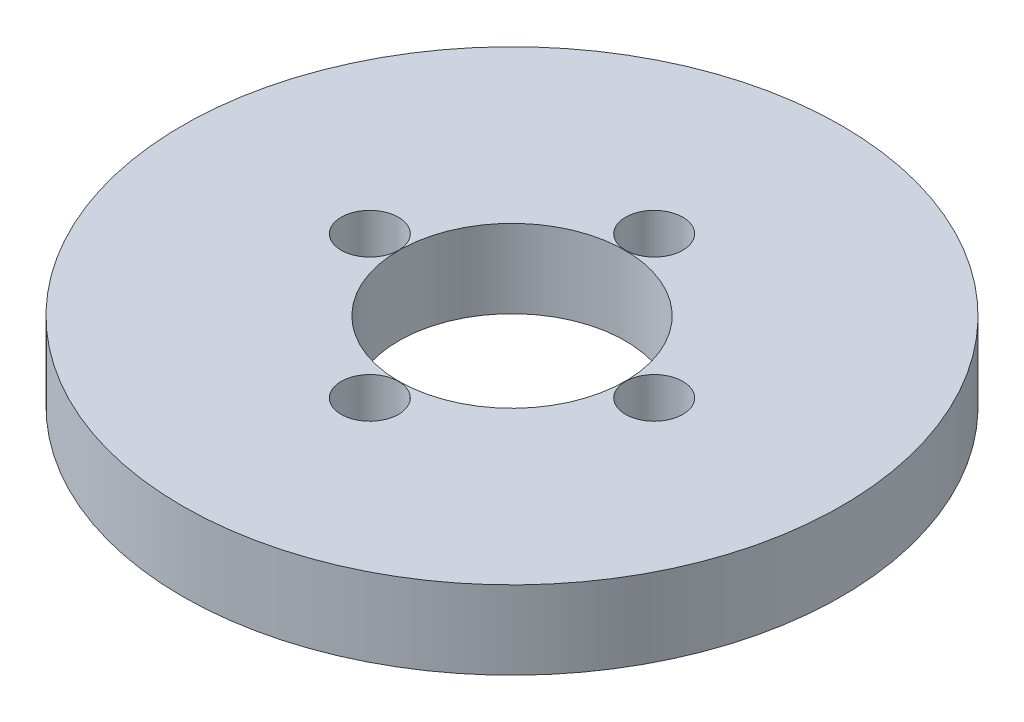
ISO-10303-21;
HEADER;
FILE_DESCRIPTION(('STEP AP214'),'2;1');
FILE_NAME('part.step','',(''),(''),'','','');
FILE_SCHEMA(('AUTOMOTIVE_DESIGN { 1 0 10303 214 1 1 1 1 }'));
ENDSEC;
DATA;
#1=APPLICATION_CONTEXT('core data for automotive mechanical design processes');
#2=APPLICATION_PROTOCOL_DEFINITION('international standard','automotive_design',2000,#1);
#3=PRODUCT_CONTEXT('',#1,'mechanical');
#4=PRODUCT('Part','Part','',(#3));
#5=PRODUCT_RELATED_PRODUCT_CATEGORY('part','',(#4));
#6=PRODUCT_DEFINITION_FORMATION('','',#4);
#7=PRODUCT_DEFINITION_CONTEXT('part definition',#1,'design');
#8=PRODUCT_DEFINITION('design','',#6,#7);
#9=PRODUCT_DEFINITION_SHAPE('','',#8);
#10=(LENGTH_UNIT() NAMED_UNIT(*) SI_UNIT(.MILLI.,.METRE.));
#11=(NAMED_UNIT(*) PLANE_ANGLE_UNIT() SI_UNIT($,.RADIAN.));
#12=(NAMED_UNIT(*) SI_UNIT($,.STERADIAN.) SOLID_ANGLE_UNIT());
#13=UNCERTAINTY_MEASURE_WITH_UNIT(LENGTH_MEASURE(1.E-05),#10,'distance_accuracy_value','');
#14=(GEOMETRIC_REPRESENTATION_CONTEXT(3) GLOBAL_UNCERTAINTY_ASSIGNED_CONTEXT((#13)) GLOBAL_UNIT_ASSIGNED_CONTEXT((#10,
#11,#12)) REPRESENTATION_CONTEXT('',''));
#15=CARTESIAN_POINT('',(0.,0.,0.));
#16=DIRECTION('',(0.,0.,1.));
#17=DIRECTION('',(1.,0.,0.));
#18=AXIS2_PLACEMENT_3D('',#15,#16,#17);
#19=CARTESIAN_POINT('',(0.,19.,0.));
#20=DIRECTION('',(0.,-1.,0.));
#21=DIRECTION('',(0.,0.,-1.));
#22=AXIS2_PLACEMENT_3D('',#19,#20,#21);
#23=CYLINDRICAL_SURFACE('',#22,80.);
#24=CARTESIAN_POINT('',(0.,19.,0.));
#25=DIRECTION('',(0.,1.,0.));
#26=DIRECTION('',(0.,0.,1.));
#27=AXIS2_PLACEMENT_3D('',#24,#25,#26);
#28=CIRCLE('',#27,80.);
#29=CARTESIAN_POINT('',(0.,19.,80.));
#30=VERTEX_POINT('',#29);
#31=EDGE_CURVE('E10',#30,#30,#28,.T.);
#32=ORIENTED_EDGE('',*,*,#31,.F.);
#33=EDGE_LOOP('',(#32));
#34=FACE_BOUND('',#33,.T.);
#35=CARTESIAN_POINT('',(0.,0.,0.));
#36=DIRECTION('',(0.,1.,0.));
#37=DIRECTION('',(0.,0.,1.));
#38=AXIS2_PLACEMENT_3D('',#35,#36,#37);
#39=CIRCLE('',#38,80.);
#40=CARTESIAN_POINT('',(0.,0.,80.));
#41=VERTEX_POINT('',#40);
#42=EDGE_CURVE('E37',#41,#41,#39,.T.);
#43=ORIENTED_EDGE('',*,*,#42,.T.);
#44=EDGE_LOOP('',(#43));
#45=FACE_BOUND('',#44,.T.);
#46=ADVANCED_FACE('F40',(#34,#45),#23,.T.);
#47=CARTESIAN_POINT('',(0.,19.,0.));
#48=DIRECTION('',(0.,1.,0.));
#49=DIRECTION('',(0.,0.,1.));
#50=AXIS2_PLACEMENT_3D('',#47,#48,#49);
#51=PLANE('',#50);
#52=CARTESIAN_POINT('',(1.20508063124342E-13,19.,34.5148810574115));
#53=DIRECTION('',(0.,1.,0.));
#54=DIRECTION('',(1.,0.,0.));
#55=AXIS2_PLACEMENT_3D('',#52,#53,#54);
#56=CIRCLE('',#55,6.95431662732869);
#57=CARTESIAN_POINT('',(6.95431662732881,19.,34.5148810574114));
#58=VERTEX_POINT('',#57);
#59=EDGE_CURVE('E71',#58,#58,#56,.T.);
#60=ORIENTED_EDGE('',*,*,#59,.F.);
#61=EDGE_LOOP('',(#60));
#62=FACE_BOUND('',#61,.T.);
#63=CARTESIAN_POINT('',(34.5148810574115,19.,0.));
#64=DIRECTION('',(0.,1.,0.));
#65=DIRECTION('',(0.,0.,-1.));
#66=AXIS2_PLACEMENT_3D('',#63,#64,#65);
#67=CIRCLE('',#66,6.95431662732869);
#68=CARTESIAN_POINT('',(34.5148810574115,19.,-6.95431662732869));
#69=VERTEX_POINT('',#68);
#70=EDGE_CURVE('E70',#69,#69,#67,.T.);
#71=ORIENTED_EDGE('',*,*,#70,.F.);
#72=EDGE_LOOP('',(#71));
#73=FACE_BOUND('',#72,.T.);
#74=CARTESIAN_POINT('',(-3.61524189373027E-13,19.,-34.5148810574115));
#75=DIRECTION('',(0.,1.,0.));
#76=DIRECTION('',(-1.,0.,0.));
#77=AXIS2_PLACEMENT_3D('',#74,#75,#76);
#78=CIRCLE('',#77,6.95431662732869);
#79=CARTESIAN_POINT('',(-6.95431662732905,19.,-34.5148810574114));
#80=VERTEX_POINT('',#79);
#81=EDGE_CURVE('E61',#80,#80,#78,.T.);
#82=ORIENTED_EDGE('',*,*,#81,.F.);
#83=EDGE_LOOP('',(#82));
#84=FACE_BOUND('',#83,.T.);
#85=CARTESIAN_POINT('',(-34.5148810574115,19.,0.));
#86=DIRECTION('',(0.,1.,0.));
#87=DIRECTION('',(0.,0.,1.));
#88=AXIS2_PLACEMENT_3D('',#85,#86,#87);
#89=CIRCLE('',#88,6.95431662732869);
#90=CARTESIAN_POINT('',(-34.5148810574115,19.,6.95431662732869));
#91=VERTEX_POINT('',#90);
#92=EDGE_CURVE('E54',#91,#91,#89,.T.);
#93=ORIENTED_EDGE('',*,*,#92,.F.);
#94=EDGE_LOOP('',(#93));
#95=FACE_BOUND('',#94,.T.);
#96=CARTESIAN_POINT('',(0.,19.,0.));
#97=DIRECTION('',(0.,1.,0.));
#98=DIRECTION('',(0.,0.,1.));
#99=AXIS2_PLACEMENT_3D('',#96,#97,#98);
#100=CIRCLE('',#99,27.5);
#101=CARTESIAN_POINT('',(0.,19.,27.5));
#102=VERTEX_POINT('',#101);
#103=EDGE_CURVE('E50',#102,#102,#100,.T.);
#104=ORIENTED_EDGE('',*,*,#103,.F.);
#105=EDGE_LOOP('',(#104));
#106=FACE_BOUND('',#105,.T.);
#107=ORIENTED_EDGE('',*,*,#31,.T.);
#108=EDGE_LOOP('',(#107));
#109=FACE_BOUND('',#108,.T.);
#110=ADVANCED_FACE('F86',(#62,#73,#84,#95,#106,#109),#51,.T.);
#111=CARTESIAN_POINT('',(0.,0.,0.));
#112=DIRECTION('',(0.,1.,0.));
#113=DIRECTION('',(0.,0.,1.));
#114=AXIS2_PLACEMENT_3D('',#111,#112,#113);
#115=PLANE('',#114);
#116=CARTESIAN_POINT('',(0.,0.,0.));
#117=DIRECTION('',(0.,1.,0.));
#118=DIRECTION('',(0.,0.,1.));
#119=AXIS2_PLACEMENT_3D('',#116,#117,#118);
#120=CIRCLE('',#119,27.5);
#121=CARTESIAN_POINT('',(0.,0.,27.5));
#122=VERTEX_POINT('',#121);
#123=EDGE_CURVE('E47',#122,#122,#120,.T.);
#124=ORIENTED_EDGE('',*,*,#123,.T.);
#125=EDGE_LOOP('',(#124));
#126=FACE_BOUND('',#125,.T.);
#127=ORIENTED_EDGE('',*,*,#42,.F.);
#128=EDGE_LOOP('',(#127));
#129=FACE_BOUND('',#128,.T.);
#130=ADVANCED_FACE('F93',(#126,#129),#115,.F.);
#131=CARTESIAN_POINT('',(0.,19.,0.));
#132=DIRECTION('',(0.,-1.,0.));
#133=DIRECTION('',(0.,0.,-1.));
#134=AXIS2_PLACEMENT_3D('',#131,#132,#133);
#135=CYLINDRICAL_SURFACE('',#134,27.5);
#136=ORIENTED_EDGE('',*,*,#103,.T.);
#137=EDGE_LOOP('',(#136));
#138=FACE_BOUND('',#137,.T.);
#139=ORIENTED_EDGE('',*,*,#123,.F.);
#140=EDGE_LOOP('',(#139));
#141=FACE_BOUND('',#140,.T.);
#142=ADVANCED_FACE('F101',(#138,#141),#135,.F.);
#143=CARTESIAN_POINT('',(-34.5148810574115,5.85470918010694,0.));
#144=DIRECTION('',(0.,1.,0.));
#145=DIRECTION('',(0.,0.,1.));
#146=AXIS2_PLACEMENT_3D('',#143,#144,#145);
#147=CYLINDRICAL_SURFACE('',#146,6.95431662732869);
#148=CARTESIAN_POINT('',(-34.5148810574115,5.85470918010694,0.));
#149=DIRECTION('',(0.,1.,0.));
#150=DIRECTION('',(0.,0.,1.));
#151=AXIS2_PLACEMENT_3D('',#148,#149,#150);
#152=CIRCLE('',#151,6.95431662732869);
#153=CARTESIAN_POINT('',(-34.5148810574115,5.85470918010694,6.95431662732869));
#154=VERTEX_POINT('',#153);
#155=EDGE_CURVE('E55',#154,#154,#152,.T.);
#156=ORIENTED_EDGE('',*,*,#155,.F.);
#157=EDGE_LOOP('',(#156));
#158=FACE_BOUND('',#157,.T.);
#159=ORIENTED_EDGE('',*,*,#92,.T.);
#160=EDGE_LOOP('',(#159));
#161=FACE_BOUND('',#160,.T.);
#162=ADVANCED_FACE('F102',(#158,#161),#147,.F.);
#163=CARTESIAN_POINT('',(-34.5148810574115,5.85470918010694,0.));
#164=DIRECTION('',(0.,1.,0.));
#165=DIRECTION('',(0.,0.,1.));
#166=AXIS2_PLACEMENT_3D('',#163,#164,#165);
#167=PLANE('',#166);
#168=ORIENTED_EDGE('',*,*,#155,.T.);
#169=EDGE_LOOP('',(#168));
#170=FACE_BOUND('',#169,.T.);
#171=ADVANCED_FACE('F133',(#170),#167,.T.);
#172=CARTESIAN_POINT('',(-3.61524189373027E-13,5.85470918010694,-34.5148810574115));
#173=DIRECTION('',(0.,1.,0.));
#174=DIRECTION('',(0.,0.,1.));
#175=AXIS2_PLACEMENT_3D('',#172,#173,#174);
#176=CYLINDRICAL_SURFACE('',#175,6.95431662732869);
#177=CARTESIAN_POINT('',(-3.61524189373027E-13,5.85470918010694,-34.5148810574115));
#178=DIRECTION('',(0.,1.,0.));
#179=DIRECTION('',(-1.,0.,0.));
#180=AXIS2_PLACEMENT_3D('',#177,#178,#179);
#181=CIRCLE('',#180,6.95431662732869);
#182=CARTESIAN_POINT('',(-6.95431662732905,5.85470918010694,-34.5148810574114));
#183=VERTEX_POINT('',#182);
#184=EDGE_CURVE('E63',#183,#183,#181,.T.);
#185=ORIENTED_EDGE('',*,*,#184,.F.);
#186=EDGE_LOOP('',(#185));
#187=FACE_BOUND('',#186,.T.);
#188=ORIENTED_EDGE('',*,*,#81,.T.);
#189=EDGE_LOOP('',(#188));
#190=FACE_BOUND('',#189,.T.);
#191=ADVANCED_FACE('F142',(#187,#190),#176,.F.);
#192=CARTESIAN_POINT('',(-3.61524189373027E-13,5.85470918010694,-34.5148810574115));
#193=DIRECTION('',(0.,1.,0.));
#194=DIRECTION('',(-1.,0.,0.));
#195=AXIS2_PLACEMENT_3D('',#192,#193,#194);
#196=PLANE('',#195);
#197=ORIENTED_EDGE('',*,*,#184,.T.);
#198=EDGE_LOOP('',(#197));
#199=FACE_BOUND('',#198,.T.);
#200=ADVANCED_FACE('F156',(#199),#196,.T.);
#201=CARTESIAN_POINT('',(34.5148810574115,5.85470918010694,0.));
#202=DIRECTION('',(0.,1.,0.));
#203=DIRECTION('',(0.,0.,1.));
#204=AXIS2_PLACEMENT_3D('',#201,#202,#203);
#205=CYLINDRICAL_SURFACE('',#204,6.95431662732869);
#206=CARTESIAN_POINT('',(34.5148810574115,5.85470918010694,0.));
#207=DIRECTION('',(0.,1.,0.));
#208=DIRECTION('',(0.,0.,-1.));
#209=AXIS2_PLACEMENT_3D('',#206,#207,#208);
#210=CIRCLE('',#209,6.95431662732869);
#211=CARTESIAN_POINT('',(34.5148810574115,5.85470918010694,-6.95431662732869));
#212=VERTEX_POINT('',#211);
#213=EDGE_CURVE('E69',#212,#212,#210,.T.);
#214=ORIENTED_EDGE('',*,*,#213,.F.);
#215=EDGE_LOOP('',(#214));
#216=FACE_BOUND('',#215,.T.);
#217=ORIENTED_EDGE('',*,*,#70,.T.);
#218=EDGE_LOOP('',(#217));
#219=FACE_BOUND('',#218,.T.);
#220=ADVANCED_FACE('F164',(#216,#219),#205,.F.);
#221=CARTESIAN_POINT('',(34.5148810574115,5.85470918010694,0.));
#222=DIRECTION('',(0.,1.,0.));
#223=DIRECTION('',(0.,0.,-1.));
#224=AXIS2_PLACEMENT_3D('',#221,#222,#223);
#225=PLANE('',#224);
#226=ORIENTED_EDGE('',*,*,#213,.T.);
#227=EDGE_LOOP('',(#226));
#228=FACE_BOUND('',#227,.T.);
#229=ADVANCED_FACE('F83',(#228),#225,.T.);
#230=CARTESIAN_POINT('',(1.20508063124342E-13,5.85470918010694,34.5148810574115));
#231=DIRECTION('',(0.,1.,0.));
#232=DIRECTION('',(0.,0.,1.));
#233=AXIS2_PLACEMENT_3D('',#230,#231,#232);
#234=CYLINDRICAL_SURFACE('',#233,6.95431662732869);
#235=CARTESIAN_POINT('',(1.20508063124342E-13,5.85470918010694,34.5148810574115));
#236=DIRECTION('',(0.,1.,0.));
#237=DIRECTION('',(1.,0.,0.));
#238=AXIS2_PLACEMENT_3D('',#235,#236,#237);
#239=CIRCLE('',#238,6.95431662732869);
#240=CARTESIAN_POINT('',(6.95431662732881,5.85470918010694,34.5148810574114));
#241=VERTEX_POINT('',#240);
#242=EDGE_CURVE('E59',#241,#241,#239,.T.);
#243=ORIENTED_EDGE('',*,*,#242,.F.);
#244=EDGE_LOOP('',(#243));
#245=FACE_BOUND('',#244,.T.);
#246=ORIENTED_EDGE('',*,*,#59,.T.);
#247=EDGE_LOOP('',(#246));
#248=FACE_BOUND('',#247,.T.);
#249=ADVANCED_FACE('F81',(#245,#248),#234,.F.);
#250=CARTESIAN_POINT('',(1.20508063124342E-13,5.85470918010694,34.5148810574115));
#251=DIRECTION('',(0.,1.,0.));
#252=DIRECTION('',(1.,0.,0.));
#253=AXIS2_PLACEMENT_3D('',#250,#251,#252);
#254=PLANE('',#253);
#255=ORIENTED_EDGE('',*,*,#242,.T.);
#256=EDGE_LOOP('',(#255));
#257=FACE_BOUND('',#256,.T.);
#258=ADVANCED_FACE('F78',(#257),#254,.T.);
#259=CLOSED_SHELL('',(#46,#110,#130,#142,#162,#171,#191,#200,#220,#229,#249,#258));
#260=MANIFOLD_SOLID_BREP('B2',#259);
#261=ADVANCED_BREP_SHAPE_REPRESENTATION('',(#18,#260),#14);
#262=SHAPE_DEFINITION_REPRESENTATION(#9,#261);
ENDSEC;
END-ISO-10303-21;
